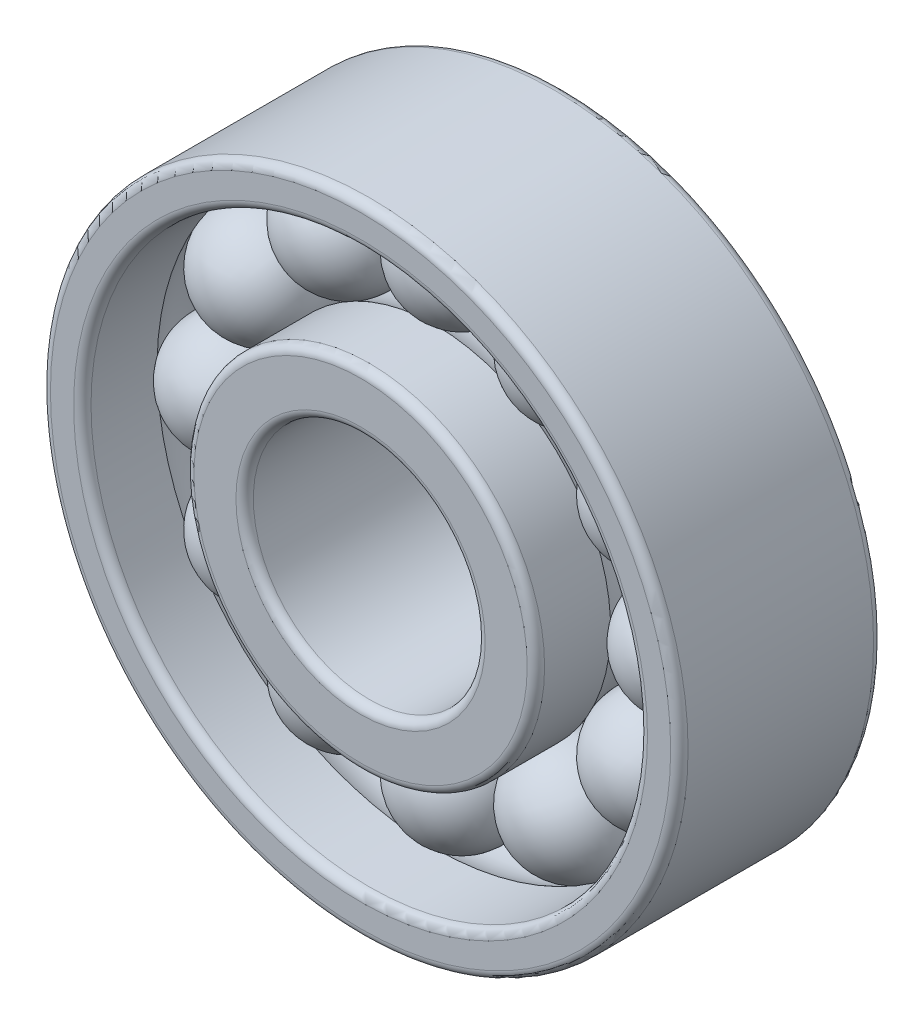
ISO-10303-21;
HEADER;
FILE_DESCRIPTION(('STEP AP214'),'2;1');
FILE_NAME('part.step','',(''),(''),'','','');
FILE_SCHEMA(('AUTOMOTIVE_DESIGN { 1 0 10303 214 1 1 1 1 }'));
ENDSEC;
DATA;
#1=APPLICATION_CONTEXT('core data for automotive mechanical design processes');
#2=APPLICATION_PROTOCOL_DEFINITION('international standard','automotive_design',2000,#1);
#3=PRODUCT_CONTEXT('',#1,'mechanical');
#4=PRODUCT('Part','Part','',(#3));
#5=PRODUCT_RELATED_PRODUCT_CATEGORY('part','',(#4));
#6=PRODUCT_DEFINITION_FORMATION('','',#4);
#7=PRODUCT_DEFINITION_CONTEXT('part definition',#1,'design');
#8=PRODUCT_DEFINITION('design','',#6,#7);
#9=PRODUCT_DEFINITION_SHAPE('','',#8);
#10=(LENGTH_UNIT() NAMED_UNIT(*) SI_UNIT(.MILLI.,.METRE.));
#11=(NAMED_UNIT(*) PLANE_ANGLE_UNIT() SI_UNIT($,.RADIAN.));
#12=(NAMED_UNIT(*) SI_UNIT($,.STERADIAN.) SOLID_ANGLE_UNIT());
#13=UNCERTAINTY_MEASURE_WITH_UNIT(LENGTH_MEASURE(1.E-05),#10,'distance_accuracy_value','');
#14=(GEOMETRIC_REPRESENTATION_CONTEXT(3) GLOBAL_UNCERTAINTY_ASSIGNED_CONTEXT((#13)) GLOBAL_UNIT_ASSIGNED_CONTEXT((#10,
#11,#12)) REPRESENTATION_CONTEXT('',''));
#15=CARTESIAN_POINT('',(0.,0.,0.));
#16=DIRECTION('',(0.,0.,1.));
#17=DIRECTION('',(1.,0.,0.));
#18=AXIS2_PLACEMENT_3D('',#15,#16,#17);
#19=CARTESIAN_POINT('',(7.825,0.,0.));
#20=DIRECTION('',(1.,0.,0.));
#21=DIRECTION('',(0.,1.,0.));
#22=AXIS2_PLACEMENT_3D('',#19,#20,#21);
#23=SPHERICAL_SURFACE('',#22,2.);
#24=CARTESIAN_POINT('',(5.825,0.,0.));
#25=VERTEX_POINT('',#24);
#26=VERTEX_LOOP('',#25);
#27=FACE_BOUND('',#26,.T.);
#28=CARTESIAN_POINT('',(9.825,0.,0.));
#29=VERTEX_POINT('',#28);
#30=VERTEX_LOOP('',#29);
#31=FACE_BOUND('',#30,.T.);
#32=ADVANCED_FACE('P0_F16',(#27,#31),#23,.T.);
#33=CLOSED_SHELL('',(#32));
#34=MANIFOLD_SOLID_BREP('P0_B1',#33);
#35=CARTESIAN_POINT('',(6.776648784613,3.9125,0.));
#36=DIRECTION('',(0.866025403784329,0.50000000000019,0.));
#37=DIRECTION('',(-0.50000000000019,0.866025403784329,0.));
#38=AXIS2_PLACEMENT_3D('',#35,#36,#37);
#39=SPHERICAL_SURFACE('',#38,2.);
#40=CARTESIAN_POINT('',(5.04459797704434,2.91249999999962,0.));
#41=VERTEX_POINT('',#40);
#42=VERTEX_LOOP('',#41);
#43=FACE_BOUND('',#42,.T.);
#44=CARTESIAN_POINT('',(8.50869959218166,4.91250000000038,0.));
#45=VERTEX_POINT('',#44);
#46=VERTEX_LOOP('',#45);
#47=FACE_BOUND('',#46,.T.);
#48=ADVANCED_FACE('P1_F16',(#43,#47),#39,.T.);
#49=CLOSED_SHELL('',(#48));
#50=MANIFOLD_SOLID_BREP('P1_B1',#49);
#51=CARTESIAN_POINT('',(3.9125,6.776648784613,0.));
#52=DIRECTION('',(0.50000000000019,0.866025403784329,0.));
#53=DIRECTION('',(-0.866025403784329,0.50000000000019,0.));
#54=AXIS2_PLACEMENT_3D('',#51,#52,#53);
#55=SPHERICAL_SURFACE('',#54,2.);
#56=CARTESIAN_POINT('',(2.91249999999962,5.04459797704434,0.));
#57=VERTEX_POINT('',#56);
#58=VERTEX_LOOP('',#57);
#59=FACE_BOUND('',#58,.T.);
#60=CARTESIAN_POINT('',(4.91250000000038,8.50869959218166,0.));
#61=VERTEX_POINT('',#60);
#62=VERTEX_LOOP('',#61);
#63=FACE_BOUND('',#62,.T.);
#64=ADVANCED_FACE('P2_F16',(#59,#63),#55,.T.);
#65=CLOSED_SHELL('',(#64));
#66=MANIFOLD_SOLID_BREP('P2_B1',#65);
#67=CARTESIAN_POINT('',(0.,7.825,0.));
#68=DIRECTION('',(0.,1.,0.));
#69=DIRECTION('',(-1.,0.,0.));
#70=AXIS2_PLACEMENT_3D('',#67,#68,#69);
#71=SPHERICAL_SURFACE('',#70,2.);
#72=CARTESIAN_POINT('',(0.,5.825,0.));
#73=VERTEX_POINT('',#72);
#74=VERTEX_LOOP('',#73);
#75=FACE_BOUND('',#74,.T.);
#76=CARTESIAN_POINT('',(0.,9.825,0.));
#77=VERTEX_POINT('',#76);
#78=VERTEX_LOOP('',#77);
#79=FACE_BOUND('',#78,.T.);
#80=ADVANCED_FACE('P3_F16',(#75,#79),#71,.T.);
#81=CLOSED_SHELL('',(#80));
#82=MANIFOLD_SOLID_BREP('P3_B1',#81);
#83=CARTESIAN_POINT('',(-3.9125,6.776648784613,0.));
#84=DIRECTION('',(-0.50000000000019,0.866025403784329,0.));
#85=DIRECTION('',(-0.866025403784329,-0.50000000000019,0.));
#86=AXIS2_PLACEMENT_3D('',#83,#84,#85);
#87=SPHERICAL_SURFACE('',#86,2.);
#88=CARTESIAN_POINT('',(-2.91249999999962,5.04459797704434,0.));
#89=VERTEX_POINT('',#88);
#90=VERTEX_LOOP('',#89);
#91=FACE_BOUND('',#90,.T.);
#92=CARTESIAN_POINT('',(-4.91250000000038,8.50869959218166,0.));
#93=VERTEX_POINT('',#92);
#94=VERTEX_LOOP('',#93);
#95=FACE_BOUND('',#94,.T.);
#96=ADVANCED_FACE('P4_F16',(#91,#95),#87,.T.);
#97=CLOSED_SHELL('',(#96));
#98=MANIFOLD_SOLID_BREP('P4_B1',#97);
#99=CARTESIAN_POINT('',(-6.776648784613,3.9125,0.));
#100=DIRECTION('',(-0.866025403784329,0.50000000000019,0.));
#101=DIRECTION('',(-0.50000000000019,-0.866025403784329,0.));
#102=AXIS2_PLACEMENT_3D('',#99,#100,#101);
#103=SPHERICAL_SURFACE('',#102,2.);
#104=CARTESIAN_POINT('',(-5.04459797704434,2.91249999999962,0.));
#105=VERTEX_POINT('',#104);
#106=VERTEX_LOOP('',#105);
#107=FACE_BOUND('',#106,.T.);
#108=CARTESIAN_POINT('',(-8.50869959218166,4.91250000000038,0.));
#109=VERTEX_POINT('',#108);
#110=VERTEX_LOOP('',#109);
#111=FACE_BOUND('',#110,.T.);
#112=ADVANCED_FACE('P5_F16',(#107,#111),#103,.T.);
#113=CLOSED_SHELL('',(#112));
#114=MANIFOLD_SOLID_BREP('P5_B1',#113);
#115=CARTESIAN_POINT('',(-7.825,0.,0.));
#116=DIRECTION('',(-1.,0.,0.));
#117=DIRECTION('',(0.,-1.,0.));
#118=AXIS2_PLACEMENT_3D('',#115,#116,#117);
#119=SPHERICAL_SURFACE('',#118,2.);
#120=CARTESIAN_POINT('',(-5.825,0.,0.));
#121=VERTEX_POINT('',#120);
#122=VERTEX_LOOP('',#121);
#123=FACE_BOUND('',#122,.T.);
#124=CARTESIAN_POINT('',(-9.825,0.,0.));
#125=VERTEX_POINT('',#124);
#126=VERTEX_LOOP('',#125);
#127=FACE_BOUND('',#126,.T.);
#128=ADVANCED_FACE('P6_F16',(#123,#127),#119,.T.);
#129=CLOSED_SHELL('',(#128));
#130=MANIFOLD_SOLID_BREP('P6_B1',#129);
#131=CARTESIAN_POINT('',(-6.776648784613,-3.9125,0.));
#132=DIRECTION('',(-0.866025403784329,-0.50000000000019,0.));
#133=DIRECTION('',(0.50000000000019,-0.866025403784329,0.));
#134=AXIS2_PLACEMENT_3D('',#131,#132,#133);
#135=SPHERICAL_SURFACE('',#134,2.);
#136=CARTESIAN_POINT('',(-5.04459797704434,-2.91249999999962,0.));
#137=VERTEX_POINT('',#136);
#138=VERTEX_LOOP('',#137);
#139=FACE_BOUND('',#138,.T.);
#140=CARTESIAN_POINT('',(-8.50869959218166,-4.91250000000038,0.));
#141=VERTEX_POINT('',#140);
#142=VERTEX_LOOP('',#141);
#143=FACE_BOUND('',#142,.T.);
#144=ADVANCED_FACE('P7_F16',(#139,#143),#135,.T.);
#145=CLOSED_SHELL('',(#144));
#146=MANIFOLD_SOLID_BREP('P7_B1',#145);
#147=CARTESIAN_POINT('',(-3.9125,-6.776648784613,0.));
#148=DIRECTION('',(-0.50000000000019,-0.866025403784329,0.));
#149=DIRECTION('',(0.866025403784329,-0.50000000000019,0.));
#150=AXIS2_PLACEMENT_3D('',#147,#148,#149);
#151=SPHERICAL_SURFACE('',#150,2.);
#152=CARTESIAN_POINT('',(-2.91249999999962,-5.04459797704434,0.));
#153=VERTEX_POINT('',#152);
#154=VERTEX_LOOP('',#153);
#155=FACE_BOUND('',#154,.T.);
#156=CARTESIAN_POINT('',(-4.91250000000038,-8.50869959218166,0.));
#157=VERTEX_POINT('',#156);
#158=VERTEX_LOOP('',#157);
#159=FACE_BOUND('',#158,.T.);
#160=ADVANCED_FACE('P8_F16',(#155,#159),#151,.T.);
#161=CLOSED_SHELL('',(#160));
#162=MANIFOLD_SOLID_BREP('P8_B1',#161);
#163=CARTESIAN_POINT('',(0.,-7.825,0.));
#164=DIRECTION('',(0.,-1.,0.));
#165=DIRECTION('',(1.,0.,0.));
#166=AXIS2_PLACEMENT_3D('',#163,#164,#165);
#167=SPHERICAL_SURFACE('',#166,2.);
#168=CARTESIAN_POINT('',(0.,-5.825,0.));
#169=VERTEX_POINT('',#168);
#170=VERTEX_LOOP('',#169);
#171=FACE_BOUND('',#170,.T.);
#172=CARTESIAN_POINT('',(0.,-9.825,0.));
#173=VERTEX_POINT('',#172);
#174=VERTEX_LOOP('',#173);
#175=FACE_BOUND('',#174,.T.);
#176=ADVANCED_FACE('P9_F16',(#171,#175),#167,.T.);
#177=CLOSED_SHELL('',(#176));
#178=MANIFOLD_SOLID_BREP('P9_B1',#177);
#179=CARTESIAN_POINT('',(3.9125,-6.776648784613,0.));
#180=DIRECTION('',(0.50000000000019,-0.866025403784329,0.));
#181=DIRECTION('',(0.866025403784329,0.50000000000019,0.));
#182=AXIS2_PLACEMENT_3D('',#179,#180,#181);
#183=SPHERICAL_SURFACE('',#182,2.);
#184=CARTESIAN_POINT('',(2.91249999999962,-5.04459797704434,0.));
#185=VERTEX_POINT('',#184);
#186=VERTEX_LOOP('',#185);
#187=FACE_BOUND('',#186,.T.);
#188=CARTESIAN_POINT('',(4.91250000000038,-8.50869959218166,0.));
#189=VERTEX_POINT('',#188);
#190=VERTEX_LOOP('',#189);
#191=FACE_BOUND('',#190,.T.);
#192=ADVANCED_FACE('P10_F16',(#187,#191),#183,.T.);
#193=CLOSED_SHELL('',(#192));
#194=MANIFOLD_SOLID_BREP('P10_B1',#193);
#195=CARTESIAN_POINT('',(6.776648784613,-3.9125,0.));
#196=DIRECTION('',(0.866025403784329,-0.50000000000019,0.));
#197=DIRECTION('',(0.50000000000019,0.866025403784329,0.));
#198=AXIS2_PLACEMENT_3D('',#195,#196,#197);
#199=SPHERICAL_SURFACE('',#198,2.);
#200=CARTESIAN_POINT('',(5.04459797704434,-2.91249999999962,0.));
#201=VERTEX_POINT('',#200);
#202=VERTEX_LOOP('',#201);
#203=FACE_BOUND('',#202,.T.);
#204=CARTESIAN_POINT('',(8.50869959218166,-4.91250000000038,0.));
#205=VERTEX_POINT('',#204);
#206=VERTEX_LOOP('',#205);
#207=FACE_BOUND('',#206,.T.);
#208=ADVANCED_FACE('P11_F15',(#203,#207),#199,.T.);
#209=CLOSED_SHELL('',(#208));
#210=MANIFOLD_SOLID_BREP('P11_B1',#209);
#211=CARTESIAN_POINT('',(0.,0.,0.));
#212=DIRECTION('',(0.,0.,1.));
#213=DIRECTION('',(1.,0.,0.));
#214=AXIS2_PLACEMENT_3D('',#211,#212,#213);
#215=TOROIDAL_SURFACE('',#214,7.825,2.);
#216=CARTESIAN_POINT('',(0.,0.,-0.921615429558));
#217=DIRECTION('',(0.,0.,-1.));
#218=DIRECTION('',(0.,1.,0.));
#219=AXIS2_PLACEMENT_3D('',#216,#217,#218);
#220=CIRCLE('',#219,6.05);
#221=CARTESIAN_POINT('',(0.,6.05,-0.921615429558004));
#222=VERTEX_POINT('',#221);
#223=EDGE_CURVE('P12_E136',#222,#222,#220,.T.);
#224=ORIENTED_EDGE('',*,*,#223,.F.);
#225=EDGE_LOOP('',(#224));
#226=FACE_BOUND('',#225,.T.);
#227=CARTESIAN_POINT('',(0.,0.,0.921615429558));
#228=DIRECTION('',(0.,0.,-1.));
#229=DIRECTION('',(0.,1.,0.));
#230=AXIS2_PLACEMENT_3D('',#227,#228,#229);
#231=CIRCLE('',#230,6.05);
#232=CARTESIAN_POINT('',(0.,6.05,0.921615429557996));
#233=VERTEX_POINT('',#232);
#234=EDGE_CURVE('P12_E143',#233,#233,#231,.F.);
#235=ORIENTED_EDGE('',*,*,#234,.F.);
#236=EDGE_LOOP('',(#235));
#237=FACE_BOUND('',#236,.T.);
#238=ADVANCED_FACE('P12_F15',(#226,#237),#215,.F.);
#239=CARTESIAN_POINT('',(0.,0.,3.199999986857));
#240=DIRECTION('',(0.,0.,-1.));
#241=DIRECTION('',(0.,1.,0.));
#242=AXIS2_PLACEMENT_3D('',#239,#240,#241);
#243=CYLINDRICAL_SURFACE('',#242,6.05);
#244=ORIENTED_EDGE('',*,*,#234,.T.);
#245=EDGE_LOOP('',(#244));
#246=FACE_BOUND('',#245,.T.);
#247=CARTESIAN_POINT('',(0.,0.,3.2));
#248=DIRECTION('',(0.,0.,1.));
#249=DIRECTION('',(1.,0.,0.));
#250=AXIS2_PLACEMENT_3D('',#247,#248,#249);
#251=CIRCLE('',#250,6.05);
#252=CARTESIAN_POINT('',(6.05,0.,3.2));
#253=VERTEX_POINT('',#252);
#254=EDGE_CURVE('P12_E108',#253,#253,#251,.T.);
#255=ORIENTED_EDGE('',*,*,#254,.F.);
#256=EDGE_LOOP('',(#255));
#257=FACE_BOUND('',#256,.T.);
#258=ADVANCED_FACE('P12_F147',(#246,#257),#243,.T.);
#259=CARTESIAN_POINT('',(0.,0.,-0.921615429558));
#260=DIRECTION('',(0.,0.,-1.));
#261=DIRECTION('',(0.,1.,0.));
#262=AXIS2_PLACEMENT_3D('',#259,#260,#261);
#263=CYLINDRICAL_SURFACE('',#262,6.05);
#264=CARTESIAN_POINT('',(0.,0.,-3.199999976888));
#265=DIRECTION('',(0.,0.,1.));
#266=DIRECTION('',(1.,0.,0.));
#267=AXIS2_PLACEMENT_3D('',#264,#265,#266);
#268=CIRCLE('',#267,6.05);
#269=CARTESIAN_POINT('',(6.05,0.,-3.199999976888));
#270=VERTEX_POINT('',#269);
#271=EDGE_CURVE('P12_E104',#270,#270,#268,.F.);
#272=ORIENTED_EDGE('',*,*,#271,.F.);
#273=EDGE_LOOP('',(#272));
#274=FACE_BOUND('',#273,.T.);
#275=ORIENTED_EDGE('',*,*,#223,.T.);
#276=EDGE_LOOP('',(#275));
#277=FACE_BOUND('',#276,.T.);
#278=ADVANCED_FACE('P12_F129',(#274,#277),#263,.T.);
#279=CARTESIAN_POINT('',(0.,0.,3.2));
#280=DIRECTION('',(0.,0.,1.));
#281=DIRECTION('',(1.,0.,0.));
#282=AXIS2_PLACEMENT_3D('',#279,#280,#281);
#283=TOROIDAL_SURFACE('',#282,5.75,0.3);
#284=CARTESIAN_POINT('',(0.,0.,3.49999999999999));
#285=DIRECTION('',(0.,0.,-1.));
#286=DIRECTION('',(1.,0.,0.));
#287=AXIS2_PLACEMENT_3D('',#284,#285,#286);
#288=CIRCLE('',#287,5.75000005988);
#289=CARTESIAN_POINT('',(5.75000005988,0.,3.49999999999999));
#290=VERTEX_POINT('',#289);
#291=EDGE_CURVE('P12_E107',#290,#290,#288,.T.);
#292=ORIENTED_EDGE('',*,*,#291,.T.);
#293=EDGE_LOOP('',(#292));
#294=FACE_BOUND('',#293,.T.);
#295=ORIENTED_EDGE('',*,*,#254,.T.);
#296=EDGE_LOOP('',(#295));
#297=FACE_BOUND('',#296,.T.);
#298=ADVANCED_FACE('P12_F125',(#294,#297),#283,.T.);
#299=CARTESIAN_POINT('',(0.,0.,-3.199999976888));
#300=DIRECTION('',(0.,0.,1.));
#301=DIRECTION('',(1.,0.,0.));
#302=AXIS2_PLACEMENT_3D('',#299,#300,#301);
#303=TOROIDAL_SURFACE('',#302,5.749999976888,0.300000023112);
#304=ORIENTED_EDGE('',*,*,#271,.T.);
#305=EDGE_LOOP('',(#304));
#306=FACE_BOUND('',#305,.T.);
#307=CARTESIAN_POINT('',(0.,0.,-3.5));
#308=DIRECTION('',(0.,0.,1.));
#309=DIRECTION('',(1.,0.,0.));
#310=AXIS2_PLACEMENT_3D('',#307,#308,#309);
#311=CIRCLE('',#310,5.74999998057);
#312=CARTESIAN_POINT('',(5.74999998057,0.,-3.5));
#313=VERTEX_POINT('',#312);
#314=EDGE_CURVE('P12_E113',#313,#313,#311,.F.);
#315=ORIENTED_EDGE('',*,*,#314,.F.);
#316=EDGE_LOOP('',(#315));
#317=FACE_BOUND('',#316,.T.);
#318=ADVANCED_FACE('P12_F78',(#306,#317),#303,.T.);
#319=CARTESIAN_POINT('',(0.,0.,3.5));
#320=DIRECTION('',(0.,0.,-1.));
#321=DIRECTION('',(0.,1.,0.));
#322=AXIS2_PLACEMENT_3D('',#319,#320,#321);
#323=PLANE('',#322);
#324=ORIENTED_EDGE('',*,*,#291,.F.);
#325=EDGE_LOOP('',(#324));
#326=FACE_BOUND('',#325,.T.);
#327=CARTESIAN_POINT('',(0.,0.,3.5));
#328=DIRECTION('',(0.,0.,1.));
#329=DIRECTION('',(1.,0.,0.));
#330=AXIS2_PLACEMENT_3D('',#327,#328,#329);
#331=CIRCLE('',#330,4.300000035918);
#332=CARTESIAN_POINT('',(4.300000035918,0.,3.5));
#333=VERTEX_POINT('',#332);
#334=EDGE_CURVE('P12_E61',#333,#333,#331,.T.);
#335=ORIENTED_EDGE('',*,*,#334,.F.);
#336=EDGE_LOOP('',(#335));
#337=FACE_BOUND('',#336,.T.);
#338=ADVANCED_FACE('P12_F68',(#326,#337),#323,.F.);
#339=CARTESIAN_POINT('',(0.,0.,-3.5));
#340=DIRECTION('',(0.,0.,-1.));
#341=DIRECTION('',(0.,1.,0.));
#342=AXIS2_PLACEMENT_3D('',#339,#340,#341);
#343=PLANE('',#342);
#344=CARTESIAN_POINT('',(0.,0.,-3.5));
#345=DIRECTION('',(0.,0.,-1.));
#346=DIRECTION('',(1.,0.,0.));
#347=AXIS2_PLACEMENT_3D('',#344,#345,#346);
#348=CIRCLE('',#347,4.300000035918);
#349=CARTESIAN_POINT('',(4.300000035918,0.,-3.5));
#350=VERTEX_POINT('',#349);
#351=EDGE_CURVE('P12_E27',#350,#350,#348,.T.);
#352=ORIENTED_EDGE('',*,*,#351,.F.);
#353=EDGE_LOOP('',(#352));
#354=FACE_BOUND('',#353,.T.);
#355=ORIENTED_EDGE('',*,*,#314,.T.);
#356=EDGE_LOOP('',(#355));
#357=FACE_BOUND('',#356,.T.);
#358=ADVANCED_FACE('P12_F77',(#354,#357),#343,.T.);
#359=CARTESIAN_POINT('',(0.,0.,3.199999934254));
#360=DIRECTION('',(0.,0.,1.));
#361=DIRECTION('',(1.,0.,0.));
#362=AXIS2_PLACEMENT_3D('',#359,#360,#361);
#363=TOROIDAL_SURFACE('',#362,4.300000065746,0.300000065746);
#364=CARTESIAN_POINT('',(0.,0.,3.199999973931));
#365=DIRECTION('',(0.,0.,1.));
#366=DIRECTION('',(0.,-1.,0.));
#367=AXIS2_PLACEMENT_3D('',#364,#365,#366);
#368=CIRCLE('',#367,4.);
#369=CARTESIAN_POINT('',(0.,-4.,3.199999973931));
#370=VERTEX_POINT('',#369);
#371=EDGE_CURVE('P12_E22',#370,#370,#368,.F.);
#372=ORIENTED_EDGE('',*,*,#371,.T.);
#373=EDGE_LOOP('',(#372));
#374=FACE_BOUND('',#373,.T.);
#375=ORIENTED_EDGE('',*,*,#334,.T.);
#376=EDGE_LOOP('',(#375));
#377=FACE_BOUND('',#376,.T.);
#378=ADVANCED_FACE('P12_F41',(#374,#377),#363,.T.);
#379=CARTESIAN_POINT('',(0.,0.,-3.199999976888));
#380=DIRECTION('',(0.,0.,1.));
#381=DIRECTION('',(1.,0.,0.));
#382=AXIS2_PLACEMENT_3D('',#379,#380,#381);
#383=TOROIDAL_SURFACE('',#382,4.300000023112,0.300000023112);
#384=ORIENTED_EDGE('',*,*,#351,.T.);
#385=EDGE_LOOP('',(#384));
#386=FACE_BOUND('',#385,.T.);
#387=CARTESIAN_POINT('',(0.,0.,-3.199999973931));
#388=DIRECTION('',(0.,0.,1.));
#389=DIRECTION('',(0.,-1.,0.));
#390=AXIS2_PLACEMENT_3D('',#387,#388,#389);
#391=CIRCLE('',#390,4.);
#392=CARTESIAN_POINT('',(0.,-4.,-3.199999973931));
#393=VERTEX_POINT('',#392);
#394=EDGE_CURVE('P12_E10',#393,#393,#391,.T.);
#395=ORIENTED_EDGE('',*,*,#394,.T.);
#396=EDGE_LOOP('',(#395));
#397=FACE_BOUND('',#396,.T.);
#398=ADVANCED_FACE('P12_F35',(#386,#397),#383,.T.);
#399=CARTESIAN_POINT('',(0.,0.,-3.199999973931));
#400=DIRECTION('',(0.,0.,1.));
#401=DIRECTION('',(0.,-1.,0.));
#402=AXIS2_PLACEMENT_3D('',#399,#400,#401);
#403=CYLINDRICAL_SURFACE('',#402,4.);
#404=ORIENTED_EDGE('',*,*,#371,.F.);
#405=EDGE_LOOP('',(#404));
#406=FACE_BOUND('',#405,.T.);
#407=ORIENTED_EDGE('',*,*,#394,.F.);
#408=EDGE_LOOP('',(#407));
#409=FACE_BOUND('',#408,.T.);
#410=ADVANCED_FACE('P12_F40',(#406,#409),#403,.F.);
#411=CLOSED_SHELL('',(#238,#258,#278,#298,#318,#338,#358,#378,#398,#410));
#412=MANIFOLD_SOLID_BREP('P12_B1',#411);
#413=CARTESIAN_POINT('',(0.,0.,0.));
#414=DIRECTION('',(0.,0.,1.));
#415=DIRECTION('',(1.,0.,0.));
#416=AXIS2_PLACEMENT_3D('',#413,#414,#415);
#417=TOROIDAL_SURFACE('',#416,7.825,2.);
#418=CARTESIAN_POINT('',(0.,0.,0.921615429558));
#419=DIRECTION('',(0.,0.,1.));
#420=DIRECTION('',(0.,-1.,0.));
#421=AXIS2_PLACEMENT_3D('',#418,#419,#420);
#422=CIRCLE('',#421,9.6);
#423=CARTESIAN_POINT('',(0.,-9.6,0.921615429558006));
#424=VERTEX_POINT('',#423);
#425=EDGE_CURVE('P13_E143',#424,#424,#422,.T.);
#426=ORIENTED_EDGE('',*,*,#425,.T.);
#427=EDGE_LOOP('',(#426));
#428=FACE_BOUND('',#427,.T.);
#429=CARTESIAN_POINT('',(0.,0.,-0.921615429558));
#430=DIRECTION('',(0.,0.,1.));
#431=DIRECTION('',(0.,-1.,0.));
#432=AXIS2_PLACEMENT_3D('',#429,#430,#431);
#433=CIRCLE('',#432,9.6);
#434=CARTESIAN_POINT('',(0.,-9.6,-0.921615429557994));
#435=VERTEX_POINT('',#434);
#436=EDGE_CURVE('P13_E136',#435,#435,#433,.F.);
#437=ORIENTED_EDGE('',*,*,#436,.T.);
#438=EDGE_LOOP('',(#437));
#439=FACE_BOUND('',#438,.T.);
#440=ADVANCED_FACE('P13_F15',(#428,#439),#417,.F.);
#441=CARTESIAN_POINT('',(0.,0.,0.921615429558));
#442=DIRECTION('',(0.,0.,1.));
#443=DIRECTION('',(0.,-1.,0.));
#444=AXIS2_PLACEMENT_3D('',#441,#442,#443);
#445=CYLINDRICAL_SURFACE('',#444,9.6);
#446=CARTESIAN_POINT('',(0.,0.,3.2));
#447=DIRECTION('',(0.,0.,1.));
#448=DIRECTION('',(1.,0.,0.));
#449=AXIS2_PLACEMENT_3D('',#446,#447,#448);
#450=CIRCLE('',#449,9.6);
#451=CARTESIAN_POINT('',(9.6,0.,3.2));
#452=VERTEX_POINT('',#451);
#453=EDGE_CURVE('P13_E109',#452,#452,#450,.F.);
#454=ORIENTED_EDGE('',*,*,#453,.F.);
#455=EDGE_LOOP('',(#454));
#456=FACE_BOUND('',#455,.T.);
#457=ORIENTED_EDGE('',*,*,#425,.F.);
#458=EDGE_LOOP('',(#457));
#459=FACE_BOUND('',#458,.T.);
#460=ADVANCED_FACE('P13_F149',(#456,#459),#445,.F.);
#461=CARTESIAN_POINT('',(0.,0.,-3.2));
#462=DIRECTION('',(0.,0.,1.));
#463=DIRECTION('',(0.,-1.,0.));
#464=AXIS2_PLACEMENT_3D('',#461,#462,#463);
#465=CYLINDRICAL_SURFACE('',#464,9.6);
#466=ORIENTED_EDGE('',*,*,#436,.F.);
#467=EDGE_LOOP('',(#466));
#468=FACE_BOUND('',#467,.T.);
#469=CARTESIAN_POINT('',(0.,0.,-3.2));
#470=DIRECTION('',(0.,0.,1.));
#471=DIRECTION('',(1.,0.,0.));
#472=AXIS2_PLACEMENT_3D('',#469,#470,#471);
#473=CIRCLE('',#472,9.6);
#474=CARTESIAN_POINT('',(9.6,0.,-3.2));
#475=VERTEX_POINT('',#474);
#476=EDGE_CURVE('P13_E106',#475,#475,#473,.T.);
#477=ORIENTED_EDGE('',*,*,#476,.F.);
#478=EDGE_LOOP('',(#477));
#479=FACE_BOUND('',#478,.T.);
#480=ADVANCED_FACE('P13_F130',(#468,#479),#465,.F.);
#481=CARTESIAN_POINT('',(0.,0.,3.2));
#482=DIRECTION('',(0.,0.,1.));
#483=DIRECTION('',(1.,0.,0.));
#484=AXIS2_PLACEMENT_3D('',#481,#482,#483);
#485=TOROIDAL_SURFACE('',#484,9.9,0.3);
#486=ORIENTED_EDGE('',*,*,#453,.T.);
#487=EDGE_LOOP('',(#486));
#488=FACE_BOUND('',#487,.T.);
#489=CARTESIAN_POINT('',(0.,0.,3.49999999999999));
#490=DIRECTION('',(0.,0.,1.));
#491=DIRECTION('',(1.,0.,0.));
#492=AXIS2_PLACEMENT_3D('',#489,#490,#491);
#493=CIRCLE('',#492,9.89999992234);
#494=CARTESIAN_POINT('',(9.89999992234,0.,3.49999999999999));
#495=VERTEX_POINT('',#494);
#496=EDGE_CURVE('P13_E61',#495,#495,#493,.F.);
#497=ORIENTED_EDGE('',*,*,#496,.F.);
#498=EDGE_LOOP('',(#497));
#499=FACE_BOUND('',#498,.T.);
#500=ADVANCED_FACE('P13_F126',(#488,#499),#485,.T.);
#501=CARTESIAN_POINT('',(0.,0.,-3.2));
#502=DIRECTION('',(0.,0.,1.));
#503=DIRECTION('',(1.,0.,0.));
#504=AXIS2_PLACEMENT_3D('',#501,#502,#503);
#505=TOROIDAL_SURFACE('',#504,9.9,0.3);
#506=CARTESIAN_POINT('',(0.,0.,-3.5));
#507=DIRECTION('',(0.,0.,-1.));
#508=DIRECTION('',(1.,0.,0.));
#509=AXIS2_PLACEMENT_3D('',#506,#507,#508);
#510=CIRCLE('',#509,9.9);
#511=CARTESIAN_POINT('',(9.9,0.,-3.5));
#512=VERTEX_POINT('',#511);
#513=EDGE_CURVE('P13_E114',#512,#512,#510,.F.);
#514=ORIENTED_EDGE('',*,*,#513,.F.);
#515=EDGE_LOOP('',(#514));
#516=FACE_BOUND('',#515,.T.);
#517=ORIENTED_EDGE('',*,*,#476,.T.);
#518=EDGE_LOOP('',(#517));
#519=FACE_BOUND('',#518,.T.);
#520=ADVANCED_FACE('P13_F78',(#516,#519),#505,.T.);
#521=CARTESIAN_POINT('',(0.,0.,3.5));
#522=DIRECTION('',(0.,0.,1.));
#523=DIRECTION('',(0.,-1.,0.));
#524=AXIS2_PLACEMENT_3D('',#521,#522,#523);
#525=PLANE('',#524);
#526=CARTESIAN_POINT('',(0.,0.,3.5));
#527=DIRECTION('',(0.,0.,-1.));
#528=DIRECTION('',(1.,0.,0.));
#529=AXIS2_PLACEMENT_3D('',#526,#527,#528);
#530=CIRCLE('',#529,10.7);
#531=CARTESIAN_POINT('',(10.7,0.,3.5));
#532=VERTEX_POINT('',#531);
#533=EDGE_CURVE('P13_E96',#532,#532,#530,.T.);
#534=ORIENTED_EDGE('',*,*,#533,.F.);
#535=EDGE_LOOP('',(#534));
#536=FACE_BOUND('',#535,.T.);
#537=ORIENTED_EDGE('',*,*,#496,.T.);
#538=EDGE_LOOP('',(#537));
#539=FACE_BOUND('',#538,.T.);
#540=ADVANCED_FACE('P13_F68',(#536,#539),#525,.T.);
#541=CARTESIAN_POINT('',(0.,0.,-3.5));
#542=DIRECTION('',(0.,0.,-1.));
#543=DIRECTION('',(0.,1.,0.));
#544=AXIS2_PLACEMENT_3D('',#541,#542,#543);
#545=PLANE('',#544);
#546=ORIENTED_EDGE('',*,*,#513,.T.);
#547=EDGE_LOOP('',(#546));
#548=FACE_BOUND('',#547,.T.);
#549=CARTESIAN_POINT('',(0.,0.,-3.5));
#550=DIRECTION('',(0.,0.,1.));
#551=DIRECTION('',(1.,0.,0.));
#552=AXIS2_PLACEMENT_3D('',#549,#550,#551);
#553=CIRCLE('',#552,10.7);
#554=CARTESIAN_POINT('',(10.7,0.,-3.5));
#555=VERTEX_POINT('',#554);
#556=EDGE_CURVE('P13_E27',#555,#555,#553,.T.);
#557=ORIENTED_EDGE('',*,*,#556,.F.);
#558=EDGE_LOOP('',(#557));
#559=FACE_BOUND('',#558,.T.);
#560=ADVANCED_FACE('P13_F77',(#548,#559),#545,.T.);
#561=CARTESIAN_POINT('',(0.,0.,3.2));
#562=DIRECTION('',(0.,0.,1.));
#563=DIRECTION('',(1.,0.,0.));
#564=AXIS2_PLACEMENT_3D('',#561,#562,#563);
#565=TOROIDAL_SURFACE('',#564,10.7,0.3);
#566=ORIENTED_EDGE('',*,*,#533,.T.);
#567=EDGE_LOOP('',(#566));
#568=FACE_BOUND('',#567,.T.);
#569=CARTESIAN_POINT('',(0.,0.,3.2));
#570=DIRECTION('',(0.,0.,-1.));
#571=DIRECTION('',(0.,1.,0.));
#572=AXIS2_PLACEMENT_3D('',#569,#570,#571);
#573=CIRCLE('',#572,11.);
#574=CARTESIAN_POINT('',(0.,11.,3.19999999999999));
#575=VERTEX_POINT('',#574);
#576=EDGE_CURVE('P13_E22',#575,#575,#573,.T.);
#577=ORIENTED_EDGE('',*,*,#576,.F.);
#578=EDGE_LOOP('',(#577));
#579=FACE_BOUND('',#578,.T.);
#580=ADVANCED_FACE('P13_F41',(#568,#579),#565,.T.);
#581=CARTESIAN_POINT('',(0.,0.,-3.2));
#582=DIRECTION('',(0.,0.,1.));
#583=DIRECTION('',(1.,0.,0.));
#584=AXIS2_PLACEMENT_3D('',#581,#582,#583);
#585=TOROIDAL_SURFACE('',#584,10.7,0.3);
#586=CARTESIAN_POINT('',(0.,0.,-3.2));
#587=DIRECTION('',(0.,0.,-1.));
#588=DIRECTION('',(0.,1.,0.));
#589=AXIS2_PLACEMENT_3D('',#586,#587,#588);
#590=CIRCLE('',#589,11.);
#591=CARTESIAN_POINT('',(0.,11.,-3.20000000000001));
#592=VERTEX_POINT('',#591);
#593=EDGE_CURVE('P13_E10',#592,#592,#590,.F.);
#594=ORIENTED_EDGE('',*,*,#593,.F.);
#595=EDGE_LOOP('',(#594));
#596=FACE_BOUND('',#595,.T.);
#597=ORIENTED_EDGE('',*,*,#556,.T.);
#598=EDGE_LOOP('',(#597));
#599=FACE_BOUND('',#598,.T.);
#600=ADVANCED_FACE('P13_F35',(#596,#599),#585,.T.);
#601=CARTESIAN_POINT('',(0.,0.,3.2));
#602=DIRECTION('',(0.,0.,-1.));
#603=DIRECTION('',(0.,1.,0.));
#604=AXIS2_PLACEMENT_3D('',#601,#602,#603);
#605=CYLINDRICAL_SURFACE('',#604,11.);
#606=ORIENTED_EDGE('',*,*,#593,.T.);
#607=EDGE_LOOP('',(#606));
#608=FACE_BOUND('',#607,.T.);
#609=ORIENTED_EDGE('',*,*,#576,.T.);
#610=EDGE_LOOP('',(#609));
#611=FACE_BOUND('',#610,.T.);
#612=ADVANCED_FACE('P13_F40',(#608,#611),#605,.T.);
#613=CLOSED_SHELL('',(#440,#460,#480,#500,#520,#540,#560,#580,#600,#612));
#614=MANIFOLD_SOLID_BREP('P13_B1',#613);
#615=ADVANCED_BREP_SHAPE_REPRESENTATION('',(#18,#34,#50,#66,#82,#98,#114,#130,#146,#162,#178,
#194,#210,#412,#614),#14);
#616=SHAPE_DEFINITION_REPRESENTATION(#9,#615);
ENDSEC;
END-ISO-10303-21;
